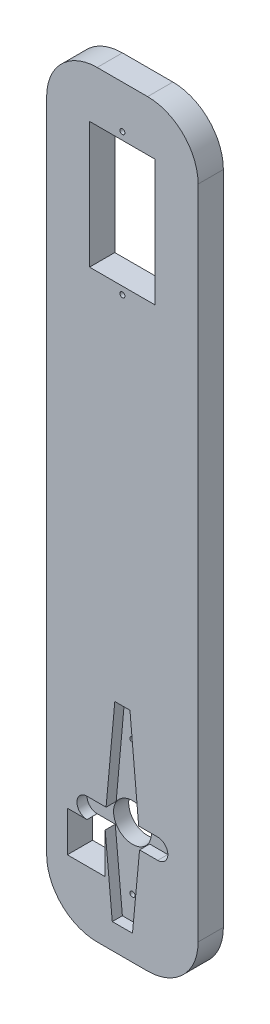
ISO-10303-21;
HEADER;
FILE_DESCRIPTION(('STEP AP214'),'2;1');
FILE_NAME('part.step','',(''),(''),'','','');
FILE_SCHEMA(('AUTOMOTIVE_DESIGN { 1 0 10303 214 1 1 1 1 }'));
ENDSEC;
DATA;
#1=APPLICATION_CONTEXT('core data for automotive mechanical design processes');
#2=APPLICATION_PROTOCOL_DEFINITION('international standard','automotive_design',2000,#1);
#3=PRODUCT_CONTEXT('',#1,'mechanical');
#4=PRODUCT('Part','Part','',(#3));
#5=PRODUCT_RELATED_PRODUCT_CATEGORY('part','',(#4));
#6=PRODUCT_DEFINITION_FORMATION('','',#4);
#7=PRODUCT_DEFINITION_CONTEXT('part definition',#1,'design');
#8=PRODUCT_DEFINITION('design','',#6,#7);
#9=PRODUCT_DEFINITION_SHAPE('','',#8);
#10=(LENGTH_UNIT() NAMED_UNIT(*) SI_UNIT(.MILLI.,.METRE.));
#11=(NAMED_UNIT(*) PLANE_ANGLE_UNIT() SI_UNIT($,.RADIAN.));
#12=(NAMED_UNIT(*) SI_UNIT($,.STERADIAN.) SOLID_ANGLE_UNIT());
#13=UNCERTAINTY_MEASURE_WITH_UNIT(LENGTH_MEASURE(1.E-05),#10,'distance_accuracy_value','');
#14=(GEOMETRIC_REPRESENTATION_CONTEXT(3) GLOBAL_UNCERTAINTY_ASSIGNED_CONTEXT((#13)) GLOBAL_UNIT_ASSIGNED_CONTEXT((#10,
#11,#12)) REPRESENTATION_CONTEXT('',''));
#15=CARTESIAN_POINT('',(0.,0.,0.));
#16=DIRECTION('',(0.,0.,1.));
#17=DIRECTION('',(1.,0.,0.));
#18=AXIS2_PLACEMENT_3D('',#15,#16,#17);
#19=CARTESIAN_POINT('',(0.,0.,5.));
#20=DIRECTION('',(0.,0.,-1.));
#21=DIRECTION('',(-1.,0.,0.));
#22=AXIS2_PLACEMENT_3D('',#19,#20,#21);
#23=PLANE('',#22);
#24=DIRECTION('',(1.,0.,0.));
#25=VECTOR('',#24,1.);
#26=CARTESIAN_POINT('',(0.,0.,5.));
#27=LINE('',#26,#25);
#28=CARTESIAN_POINT('',(10.,0.,5.));
#29=VERTEX_POINT('',#28);
#30=CARTESIAN_POINT('',(20.,0.,5.));
#31=VERTEX_POINT('',#30);
#32=EDGE_CURVE('E410',#29,#31,#27,.T.);
#33=ORIENTED_EDGE('',*,*,#32,.T.);
#34=CARTESIAN_POINT('',(20.,10.,5.));
#35=DIRECTION('',(0.,0.,-1.));
#36=DIRECTION('',(-1.,0.,0.));
#37=AXIS2_PLACEMENT_3D('',#34,#35,#36);
#38=CIRCLE('',#37,10.);
#39=CARTESIAN_POINT('',(30.,10.,5.));
#40=VERTEX_POINT('',#39);
#41=EDGE_CURVE('E454',#31,#40,#38,.F.);
#42=ORIENTED_EDGE('',*,*,#41,.T.);
#43=DIRECTION('',(0.,1.,0.));
#44=VECTOR('',#43,1.);
#45=CARTESIAN_POINT('',(30.,0.,5.));
#46=LINE('',#45,#44);
#47=CARTESIAN_POINT('',(30.,140.,5.));
#48=VERTEX_POINT('',#47);
#49=EDGE_CURVE('E414',#40,#48,#46,.T.);
#50=ORIENTED_EDGE('',*,*,#49,.T.);
#51=CARTESIAN_POINT('',(20.,140.,5.));
#52=DIRECTION('',(0.,0.,-1.));
#53=DIRECTION('',(-1.,0.,0.));
#54=AXIS2_PLACEMENT_3D('',#51,#52,#53);
#55=CIRCLE('',#54,10.);
#56=CARTESIAN_POINT('',(20.,150.,5.));
#57=VERTEX_POINT('',#56);
#58=EDGE_CURVE('E450',#48,#57,#55,.F.);
#59=ORIENTED_EDGE('',*,*,#58,.T.);
#60=DIRECTION('',(-1.,0.,0.));
#61=VECTOR('',#60,1.);
#62=CARTESIAN_POINT('',(0.,150.,5.));
#63=LINE('',#62,#61);
#64=CARTESIAN_POINT('',(10.,150.,5.));
#65=VERTEX_POINT('',#64);
#66=EDGE_CURVE('E417',#57,#65,#63,.T.);
#67=ORIENTED_EDGE('',*,*,#66,.T.);
#68=CARTESIAN_POINT('',(10.,140.,5.));
#69=DIRECTION('',(0.,0.,-1.));
#70=DIRECTION('',(-1.,0.,0.));
#71=AXIS2_PLACEMENT_3D('',#68,#69,#70);
#72=CIRCLE('',#71,10.);
#73=CARTESIAN_POINT('',(0.,140.,5.));
#74=VERTEX_POINT('',#73);
#75=EDGE_CURVE('E448',#65,#74,#72,.F.);
#76=ORIENTED_EDGE('',*,*,#75,.T.);
#77=DIRECTION('',(0.,-1.,0.));
#78=VECTOR('',#77,1.);
#79=CARTESIAN_POINT('',(0.,0.,5.));
#80=LINE('',#79,#78);
#81=CARTESIAN_POINT('',(0.,10.,5.));
#82=VERTEX_POINT('',#81);
#83=EDGE_CURVE('E407',#74,#82,#80,.T.);
#84=ORIENTED_EDGE('',*,*,#83,.T.);
#85=CARTESIAN_POINT('',(10.,10.,5.));
#86=DIRECTION('',(0.,0.,-1.));
#87=DIRECTION('',(-1.,0.,0.));
#88=AXIS2_PLACEMENT_3D('',#85,#86,#87);
#89=CIRCLE('',#88,10.);
#90=EDGE_CURVE('E452',#82,#29,#89,.F.);
#91=ORIENTED_EDGE('',*,*,#90,.T.);
#92=EDGE_LOOP('',(#33,#42,#50,#59,#67,#76,#84,#91));
#93=FACE_BOUND('',#92,.T.);
#94=DIRECTION('',(1.,0.,0.));
#95=VECTOR('',#94,1.);
#96=CARTESIAN_POINT('',(8.5,115.,5.));
#97=LINE('',#96,#95);
#98=CARTESIAN_POINT('',(8.5,115.,5.));
#99=VERTEX_POINT('',#98);
#100=CARTESIAN_POINT('',(21.5,115.,5.));
#101=VERTEX_POINT('',#100);
#102=EDGE_CURVE('E390',#99,#101,#97,.T.);
#103=ORIENTED_EDGE('',*,*,#102,.F.);
#104=DIRECTION('',(0.,-1.,0.));
#105=VECTOR('',#104,1.);
#106=CARTESIAN_POINT('',(8.5,140.,5.));
#107=LINE('',#106,#105);
#108=CARTESIAN_POINT('',(8.5,140.,5.));
#109=VERTEX_POINT('',#108);
#110=EDGE_CURVE('E366',#109,#99,#107,.T.);
#111=ORIENTED_EDGE('',*,*,#110,.F.);
#112=DIRECTION('',(-1.,0.,0.));
#113=VECTOR('',#112,1.);
#114=CARTESIAN_POINT('',(8.5,140.,5.));
#115=LINE('',#114,#113);
#116=CARTESIAN_POINT('',(21.5,140.,5.));
#117=VERTEX_POINT('',#116);
#118=EDGE_CURVE('E379',#117,#109,#115,.T.);
#119=ORIENTED_EDGE('',*,*,#118,.F.);
#120=DIRECTION('',(0.,1.,0.));
#121=VECTOR('',#120,1.);
#122=CARTESIAN_POINT('',(21.5,140.,5.));
#123=LINE('',#122,#121);
#124=EDGE_CURVE('E393',#101,#117,#123,.T.);
#125=ORIENTED_EDGE('',*,*,#124,.F.);
#126=EDGE_LOOP('',(#103,#111,#119,#125));
#127=FACE_BOUND('',#126,.T.);
#128=CARTESIAN_POINT('',(15.,113.5,5.));
#129=DIRECTION('',(0.,0.,1.));
#130=DIRECTION('',(-1.,0.,0.));
#131=AXIS2_PLACEMENT_3D('',#128,#129,#130);
#132=CIRCLE('',#131,0.500000000000001);
#133=CARTESIAN_POINT('',(14.5,113.5,5.));
#134=VERTEX_POINT('',#133);
#135=EDGE_CURVE('E342',#134,#134,#132,.T.);
#136=ORIENTED_EDGE('',*,*,#135,.F.);
#137=EDGE_LOOP('',(#136));
#138=FACE_BOUND('',#137,.T.);
#139=CARTESIAN_POINT('',(15.,141.5,5.));
#140=DIRECTION('',(0.,0.,1.));
#141=DIRECTION('',(1.,0.,0.));
#142=AXIS2_PLACEMENT_3D('',#139,#140,#141);
#143=CIRCLE('',#142,0.500000000000001);
#144=CARTESIAN_POINT('',(15.5,141.5,5.));
#145=VERTEX_POINT('',#144);
#146=EDGE_CURVE('E367',#145,#145,#143,.T.);
#147=ORIENTED_EDGE('',*,*,#146,.F.);
#148=EDGE_LOOP('',(#147));
#149=FACE_BOUND('',#148,.T.);
#150=DIRECTION('',(0.0933407086930581,-0.995634226059288,0.));
#151=VECTOR('',#150,1.);
#152=CARTESIAN_POINT('',(13.351403678606,1.25169409486931,5.));
#153=LINE('',#152,#151);
#154=CARTESIAN_POINT('',(11.59375,20.,5.));
#155=VERTEX_POINT('',#154);
#156=CARTESIAN_POINT('',(13.,5.,5.));
#157=VERTEX_POINT('',#156);
#158=EDGE_CURVE('E326',#155,#157,#153,.T.);
#159=ORIENTED_EDGE('',*,*,#158,.F.);
#160=DIRECTION('',(0.,1.,0.));
#161=VECTOR('',#160,1.);
#162=CARTESIAN_POINT('',(11.59375,20.,5.));
#163=LINE('',#162,#161);
#164=CARTESIAN_POINT('',(11.59375,12.,5.));
#165=VERTEX_POINT('',#164);
#166=EDGE_CURVE('E246',#165,#155,#163,.T.);
#167=ORIENTED_EDGE('',*,*,#166,.F.);
#168=DIRECTION('',(1.,0.,0.));
#169=VECTOR('',#168,1.);
#170=CARTESIAN_POINT('',(11.59375,12.,5.));
#171=LINE('',#170,#169);
#172=CARTESIAN_POINT('',(4.09375,12.,5.));
#173=VERTEX_POINT('',#172);
#174=EDGE_CURVE('E238',#173,#165,#171,.T.);
#175=ORIENTED_EDGE('',*,*,#174,.F.);
#176=DIRECTION('',(0.,-1.,0.));
#177=VECTOR('',#176,1.);
#178=CARTESIAN_POINT('',(4.09375,20.,5.));
#179=LINE('',#178,#177);
#180=CARTESIAN_POINT('',(4.09375,20.,5.));
#181=VERTEX_POINT('',#180);
#182=EDGE_CURVE('E241',#181,#173,#179,.T.);
#183=ORIENTED_EDGE('',*,*,#182,.F.);
#184=DIRECTION('',(-1.,0.,0.));
#185=VECTOR('',#184,1.);
#186=CARTESIAN_POINT('',(11.59375,20.,5.));
#187=LINE('',#186,#185);
#188=CARTESIAN_POINT('',(8.,20.,5.));
#189=VERTEX_POINT('',#188);
#190=EDGE_CURVE('E248',#189,#181,#187,.T.);
#191=ORIENTED_EDGE('',*,*,#190,.F.);
#192=CARTESIAN_POINT('',(8.,22.,5.));
#193=DIRECTION('',(0.,0.,1.));
#194=DIRECTION('',(1.,0.,0.));
#195=AXIS2_PLACEMENT_3D('',#192,#193,#194);
#196=CIRCLE('',#195,2.);
#197=CARTESIAN_POINT('',(8.,24.,5.));
#198=VERTEX_POINT('',#197);
#199=EDGE_CURVE('E323',#198,#189,#196,.T.);
#200=ORIENTED_EDGE('',*,*,#199,.F.);
#201=DIRECTION('',(1.,0.,0.));
#202=VECTOR('',#201,1.);
#203=CARTESIAN_POINT('',(0.,24.,5.));
#204=LINE('',#203,#202);
#205=CARTESIAN_POINT('',(11.7727272727273,24.,5.));
#206=VERTEX_POINT('',#205);
#207=EDGE_CURVE('E320',#198,#206,#204,.T.);
#208=ORIENTED_EDGE('',*,*,#207,.T.);
#209=DIRECTION('',(-0.0905357460425186,-0.995893206467704,0.));
#210=VECTOR('',#209,1.);
#211=CARTESIAN_POINT('',(9.51229508196721,-0.864754098360656,5.));
#212=LINE('',#211,#210);
#213=CARTESIAN_POINT('',(13.5,43.,5.));
#214=VERTEX_POINT('',#213);
#215=EDGE_CURVE('E317',#214,#206,#212,.T.);
#216=ORIENTED_EDGE('',*,*,#215,.F.);
#217=DIRECTION('',(1.,0.,0.));
#218=VECTOR('',#217,1.);
#219=CARTESIAN_POINT('',(0.,43.,5.));
#220=LINE('',#219,#218);
#221=CARTESIAN_POINT('',(16.5,43.,5.));
#222=VERTEX_POINT('',#221);
#223=EDGE_CURVE('E314',#214,#222,#220,.T.);
#224=ORIENTED_EDGE('',*,*,#223,.T.);
#225=DIRECTION('',(-0.0905357460425185,0.995893206467704,0.));
#226=VECTOR('',#225,1.);
#227=CARTESIAN_POINT('',(20.2418032786885,1.84016393442623,5.));
#228=LINE('',#227,#226);
#229=CARTESIAN_POINT('',(18.2272727272727,24.,5.));
#230=VERTEX_POINT('',#229);
#231=EDGE_CURVE('E311',#230,#222,#228,.T.);
#232=ORIENTED_EDGE('',*,*,#231,.F.);
#233=DIRECTION('',(1.,0.,0.));
#234=VECTOR('',#233,1.);
#235=CARTESIAN_POINT('',(0.,24.,5.));
#236=LINE('',#235,#234);
#237=CARTESIAN_POINT('',(22.,24.,5.));
#238=VERTEX_POINT('',#237);
#239=EDGE_CURVE('E56',#230,#238,#236,.T.);
#240=ORIENTED_EDGE('',*,*,#239,.T.);
#241=CARTESIAN_POINT('',(22.,22.,5.));
#242=DIRECTION('',(0.,0.,1.));
#243=DIRECTION('',(1.,0.,0.));
#244=AXIS2_PLACEMENT_3D('',#241,#242,#243);
#245=CIRCLE('',#244,2.);
#246=CARTESIAN_POINT('',(22.,20.,5.));
#247=VERTEX_POINT('',#246);
#248=EDGE_CURVE('E279',#238,#247,#245,.F.);
#249=ORIENTED_EDGE('',*,*,#248,.T.);
#250=DIRECTION('',(1.,0.,0.));
#251=VECTOR('',#250,1.);
#252=CARTESIAN_POINT('',(0.,20.,5.));
#253=LINE('',#252,#251);
#254=CARTESIAN_POINT('',(18.40625,20.,5.));
#255=VERTEX_POINT('',#254);
#256=EDGE_CURVE('E335',#255,#247,#253,.T.);
#257=ORIENTED_EDGE('',*,*,#256,.F.);
#258=DIRECTION('',(0.0933407086930581,0.995634226059288,0.));
#259=VECTOR('',#258,1.);
#260=CARTESIAN_POINT('',(16.3872216844143,-1.53630203291384,5.));
#261=LINE('',#260,#259);
#262=CARTESIAN_POINT('',(17.,5.,5.));
#263=VERTEX_POINT('',#262);
#264=EDGE_CURVE('E332',#263,#255,#261,.T.);
#265=ORIENTED_EDGE('',*,*,#264,.F.);
#266=DIRECTION('',(1.,0.,0.));
#267=VECTOR('',#266,1.);
#268=CARTESIAN_POINT('',(0.,5.,5.));
#269=LINE('',#268,#267);
#270=EDGE_CURVE('E329',#157,#263,#269,.T.);
#271=ORIENTED_EDGE('',*,*,#270,.F.);
#272=EDGE_LOOP('',(#159,#167,#175,#183,#191,#200,#208,#216,#224,#232,#240,#249,#257,#265,#271));
#273=FACE_BOUND('',#272,.T.);
#274=ADVANCED_FACE('F33',(#93,#127,#138,#149,#273),#23,.F.);
#275=CARTESIAN_POINT('',(0.,0.,5.));
#276=DIRECTION('',(1.,0.,0.));
#277=DIRECTION('',(0.,0.,-1.));
#278=AXIS2_PLACEMENT_3D('',#275,#276,#277);
#279=PLANE('',#278);
#280=DIRECTION('',(0.,-1.,0.));
#281=VECTOR('',#280,1.);
#282=CARTESIAN_POINT('',(0.,0.,0.));
#283=LINE('',#282,#281);
#284=CARTESIAN_POINT('',(0.,140.,0.));
#285=VERTEX_POINT('',#284);
#286=CARTESIAN_POINT('',(0.,10.,0.));
#287=VERTEX_POINT('',#286);
#288=EDGE_CURVE('E400',#285,#287,#283,.T.);
#289=ORIENTED_EDGE('',*,*,#288,.T.);
#290=DIRECTION('',(0.,0.,-1.));
#291=VECTOR('',#290,1.);
#292=CARTESIAN_POINT('',(0.,10.,5.));
#293=LINE('',#292,#291);
#294=EDGE_CURVE('E459',#287,#82,#293,.F.);
#295=ORIENTED_EDGE('',*,*,#294,.T.);
#296=ORIENTED_EDGE('',*,*,#83,.F.);
#297=DIRECTION('',(0.,0.,-1.));
#298=VECTOR('',#297,1.);
#299=CARTESIAN_POINT('',(0.,140.,5.));
#300=LINE('',#299,#298);
#301=EDGE_CURVE('E456',#74,#285,#300,.T.);
#302=ORIENTED_EDGE('',*,*,#301,.T.);
#303=EDGE_LOOP('',(#289,#295,#296,#302));
#304=FACE_BOUND('',#303,.T.);
#305=ADVANCED_FACE('F475',(#304),#279,.F.);
#306=CARTESIAN_POINT('',(0.,0.,5.));
#307=DIRECTION('',(0.,1.,0.));
#308=DIRECTION('',(0.,0.,1.));
#309=AXIS2_PLACEMENT_3D('',#306,#307,#308);
#310=PLANE('',#309);
#311=DIRECTION('',(1.,0.,0.));
#312=VECTOR('',#311,1.);
#313=CARTESIAN_POINT('',(0.,0.,0.));
#314=LINE('',#313,#312);
#315=CARTESIAN_POINT('',(10.,0.,0.));
#316=VERTEX_POINT('',#315);
#317=CARTESIAN_POINT('',(20.,0.,0.));
#318=VERTEX_POINT('',#317);
#319=EDGE_CURVE('E423',#316,#318,#314,.T.);
#320=ORIENTED_EDGE('',*,*,#319,.T.);
#321=DIRECTION('',(0.,0.,-1.));
#322=VECTOR('',#321,1.);
#323=CARTESIAN_POINT('',(20.,0.,5.));
#324=LINE('',#323,#322);
#325=EDGE_CURVE('E446',#318,#31,#324,.F.);
#326=ORIENTED_EDGE('',*,*,#325,.T.);
#327=ORIENTED_EDGE('',*,*,#32,.F.);
#328=DIRECTION('',(0.,0.,-1.));
#329=VECTOR('',#328,1.);
#330=CARTESIAN_POINT('',(10.,0.,5.));
#331=LINE('',#330,#329);
#332=EDGE_CURVE('E443',#29,#316,#331,.T.);
#333=ORIENTED_EDGE('',*,*,#332,.T.);
#334=EDGE_LOOP('',(#320,#326,#327,#333));
#335=FACE_BOUND('',#334,.T.);
#336=ADVANCED_FACE('F486',(#335),#310,.F.);
#337=CARTESIAN_POINT('',(30.,0.,5.));
#338=DIRECTION('',(-1.,0.,0.));
#339=DIRECTION('',(0.,0.,1.));
#340=AXIS2_PLACEMENT_3D('',#337,#338,#339);
#341=PLANE('',#340);
#342=ORIENTED_EDGE('',*,*,#49,.F.);
#343=DIRECTION('',(0.,0.,-1.));
#344=VECTOR('',#343,1.);
#345=CARTESIAN_POINT('',(30.,10.,5.));
#346=LINE('',#345,#344);
#347=CARTESIAN_POINT('',(30.,10.,0.));
#348=VERTEX_POINT('',#347);
#349=EDGE_CURVE('E432',#40,#348,#346,.T.);
#350=ORIENTED_EDGE('',*,*,#349,.T.);
#351=DIRECTION('',(0.,1.,0.));
#352=VECTOR('',#351,1.);
#353=CARTESIAN_POINT('',(30.,0.,0.));
#354=LINE('',#353,#352);
#355=CARTESIAN_POINT('',(30.,140.,0.));
#356=VERTEX_POINT('',#355);
#357=EDGE_CURVE('E426',#348,#356,#354,.T.);
#358=ORIENTED_EDGE('',*,*,#357,.T.);
#359=DIRECTION('',(0.,0.,-1.));
#360=VECTOR('',#359,1.);
#361=CARTESIAN_POINT('',(30.,140.,5.));
#362=LINE('',#361,#360);
#363=EDGE_CURVE('E420',#356,#48,#362,.F.);
#364=ORIENTED_EDGE('',*,*,#363,.T.);
#365=EDGE_LOOP('',(#342,#350,#358,#364));
#366=FACE_BOUND('',#365,.T.);
#367=ADVANCED_FACE('F494',(#366),#341,.F.);
#368=CARTESIAN_POINT('',(0.,150.,5.));
#369=DIRECTION('',(0.,-1.,0.));
#370=DIRECTION('',(0.,0.,-1.));
#371=AXIS2_PLACEMENT_3D('',#368,#369,#370);
#372=PLANE('',#371);
#373=ORIENTED_EDGE('',*,*,#66,.F.);
#374=DIRECTION('',(0.,0.,-1.));
#375=VECTOR('',#374,1.);
#376=CARTESIAN_POINT('',(20.,150.,5.));
#377=LINE('',#376,#375);
#378=CARTESIAN_POINT('',(20.,150.,0.));
#379=VERTEX_POINT('',#378);
#380=EDGE_CURVE('E11',#57,#379,#377,.T.);
#381=ORIENTED_EDGE('',*,*,#380,.T.);
#382=DIRECTION('',(-1.,0.,0.));
#383=VECTOR('',#382,1.);
#384=CARTESIAN_POINT('',(0.,150.,0.));
#385=LINE('',#384,#383);
#386=CARTESIAN_POINT('',(10.,150.,0.));
#387=VERTEX_POINT('',#386);
#388=EDGE_CURVE('E411',#379,#387,#385,.T.);
#389=ORIENTED_EDGE('',*,*,#388,.T.);
#390=DIRECTION('',(0.,0.,-1.));
#391=VECTOR('',#390,1.);
#392=CARTESIAN_POINT('',(10.,150.,5.));
#393=LINE('',#392,#391);
#394=EDGE_CURVE('E41',#387,#65,#393,.F.);
#395=ORIENTED_EDGE('',*,*,#394,.T.);
#396=EDGE_LOOP('',(#373,#381,#389,#395));
#397=FACE_BOUND('',#396,.T.);
#398=ADVANCED_FACE('F463',(#397),#372,.F.);
#399=CARTESIAN_POINT('',(0.,0.,0.));
#400=DIRECTION('',(0.,0.,-1.));
#401=DIRECTION('',(-1.,0.,0.));
#402=AXIS2_PLACEMENT_3D('',#399,#400,#401);
#403=PLANE('',#402);
#404=DIRECTION('',(0.,1.,0.));
#405=VECTOR('',#404,1.);
#406=CARTESIAN_POINT('',(11.59375,20.,0.));
#407=LINE('',#406,#405);
#408=CARTESIAN_POINT('',(11.59375,12.,0.));
#409=VERTEX_POINT('',#408);
#410=CARTESIAN_POINT('',(11.59375,20.,0.));
#411=VERTEX_POINT('',#410);
#412=EDGE_CURVE('E221',#409,#411,#407,.T.);
#413=ORIENTED_EDGE('',*,*,#412,.T.);
#414=DIRECTION('',(-1.,0.,0.));
#415=VECTOR('',#414,1.);
#416=CARTESIAN_POINT('',(11.59375,20.,0.));
#417=LINE('',#416,#415);
#418=CARTESIAN_POINT('',(4.09375,20.,0.));
#419=VERTEX_POINT('',#418);
#420=EDGE_CURVE('E231',#411,#419,#417,.T.);
#421=ORIENTED_EDGE('',*,*,#420,.T.);
#422=DIRECTION('',(0.,-1.,0.));
#423=VECTOR('',#422,1.);
#424=CARTESIAN_POINT('',(4.09375,20.,0.));
#425=LINE('',#424,#423);
#426=CARTESIAN_POINT('',(4.09375,12.,0.));
#427=VERTEX_POINT('',#426);
#428=EDGE_CURVE('E48',#419,#427,#425,.T.);
#429=ORIENTED_EDGE('',*,*,#428,.T.);
#430=DIRECTION('',(1.,0.,0.));
#431=VECTOR('',#430,1.);
#432=CARTESIAN_POINT('',(11.59375,12.,0.));
#433=LINE('',#432,#431);
#434=EDGE_CURVE('E228',#427,#409,#433,.T.);
#435=ORIENTED_EDGE('',*,*,#434,.T.);
#436=EDGE_LOOP('',(#413,#421,#429,#435));
#437=FACE_BOUND('',#436,.T.);
#438=CARTESIAN_POINT('',(15.,22.,0.));
#439=DIRECTION('',(0.,0.,1.));
#440=DIRECTION('',(1.,0.,0.));
#441=AXIS2_PLACEMENT_3D('',#438,#439,#440);
#442=CIRCLE('',#441,3.75);
#443=CARTESIAN_POINT('',(18.75,22.,0.));
#444=VERTEX_POINT('',#443);
#445=EDGE_CURVE('E258',#444,#444,#442,.T.);
#446=ORIENTED_EDGE('',*,*,#445,.T.);
#447=EDGE_LOOP('',(#446));
#448=FACE_BOUND('',#447,.T.);
#449=CARTESIAN_POINT('',(15.,36.2,0.));
#450=DIRECTION('',(0.,0.,1.));
#451=DIRECTION('',(1.,0.,0.));
#452=AXIS2_PLACEMENT_3D('',#449,#450,#451);
#453=CIRCLE('',#452,0.500000000000001);
#454=CARTESIAN_POINT('',(15.5,36.2,0.));
#455=VERTEX_POINT('',#454);
#456=EDGE_CURVE('E264',#455,#455,#453,.T.);
#457=ORIENTED_EDGE('',*,*,#456,.T.);
#458=EDGE_LOOP('',(#457));
#459=FACE_BOUND('',#458,.T.);
#460=CARTESIAN_POINT('',(15.,9.69999999999999,0.));
#461=DIRECTION('',(0.,0.,1.));
#462=DIRECTION('',(1.,0.,0.));
#463=AXIS2_PLACEMENT_3D('',#460,#461,#462);
#464=CIRCLE('',#463,0.500000000000001);
#465=CARTESIAN_POINT('',(15.5,9.69999999999999,0.));
#466=VERTEX_POINT('',#465);
#467=EDGE_CURVE('E270',#466,#466,#464,.T.);
#468=ORIENTED_EDGE('',*,*,#467,.T.);
#469=EDGE_LOOP('',(#468));
#470=FACE_BOUND('',#469,.T.);
#471=CARTESIAN_POINT('',(15.,141.5,0.));
#472=DIRECTION('',(0.,0.,1.));
#473=DIRECTION('',(1.,0.,0.));
#474=AXIS2_PLACEMENT_3D('',#471,#472,#473);
#475=CIRCLE('',#474,0.500000000000001);
#476=CARTESIAN_POINT('',(15.5,141.5,0.));
#477=VERTEX_POINT('',#476);
#478=EDGE_CURVE('E363',#477,#477,#475,.T.);
#479=ORIENTED_EDGE('',*,*,#478,.T.);
#480=EDGE_LOOP('',(#479));
#481=FACE_BOUND('',#480,.T.);
#482=CARTESIAN_POINT('',(15.,113.5,0.));
#483=DIRECTION('',(0.,0.,1.));
#484=DIRECTION('',(-1.,0.,0.));
#485=AXIS2_PLACEMENT_3D('',#482,#483,#484);
#486=CIRCLE('',#485,0.500000000000001);
#487=CARTESIAN_POINT('',(14.5,113.5,0.));
#488=VERTEX_POINT('',#487);
#489=EDGE_CURVE('E370',#488,#488,#486,.T.);
#490=ORIENTED_EDGE('',*,*,#489,.T.);
#491=EDGE_LOOP('',(#490));
#492=FACE_BOUND('',#491,.T.);
#493=DIRECTION('',(0.,-1.,0.));
#494=VECTOR('',#493,1.);
#495=CARTESIAN_POINT('',(8.5,140.,0.));
#496=LINE('',#495,#494);
#497=CARTESIAN_POINT('',(8.5,140.,0.));
#498=VERTEX_POINT('',#497);
#499=CARTESIAN_POINT('',(8.5,115.,0.));
#500=VERTEX_POINT('',#499);
#501=EDGE_CURVE('E375',#498,#500,#496,.T.);
#502=ORIENTED_EDGE('',*,*,#501,.T.);
#503=DIRECTION('',(1.,0.,0.));
#504=VECTOR('',#503,1.);
#505=CARTESIAN_POINT('',(8.5,115.,0.));
#506=LINE('',#505,#504);
#507=CARTESIAN_POINT('',(21.5,115.,0.));
#508=VERTEX_POINT('',#507);
#509=EDGE_CURVE('E378',#500,#508,#506,.T.);
#510=ORIENTED_EDGE('',*,*,#509,.T.);
#511=DIRECTION('',(0.,1.,0.));
#512=VECTOR('',#511,1.);
#513=CARTESIAN_POINT('',(21.5,140.,0.));
#514=LINE('',#513,#512);
#515=CARTESIAN_POINT('',(21.5,140.,0.));
#516=VERTEX_POINT('',#515);
#517=EDGE_CURVE('E382',#508,#516,#514,.T.);
#518=ORIENTED_EDGE('',*,*,#517,.T.);
#519=DIRECTION('',(-1.,0.,0.));
#520=VECTOR('',#519,1.);
#521=CARTESIAN_POINT('',(8.5,140.,0.));
#522=LINE('',#521,#520);
#523=EDGE_CURVE('E385',#516,#498,#522,.T.);
#524=ORIENTED_EDGE('',*,*,#523,.T.);
#525=EDGE_LOOP('',(#502,#510,#518,#524));
#526=FACE_BOUND('',#525,.T.);
#527=ORIENTED_EDGE('',*,*,#357,.F.);
#528=CARTESIAN_POINT('',(20.,10.,0.));
#529=DIRECTION('',(0.,0.,-1.));
#530=DIRECTION('',(-1.,0.,0.));
#531=AXIS2_PLACEMENT_3D('',#528,#529,#530);
#532=CIRCLE('',#531,10.);
#533=EDGE_CURVE('E441',#348,#318,#532,.T.);
#534=ORIENTED_EDGE('',*,*,#533,.T.);
#535=ORIENTED_EDGE('',*,*,#319,.F.);
#536=CARTESIAN_POINT('',(10.,10.,0.));
#537=DIRECTION('',(0.,0.,-1.));
#538=DIRECTION('',(-1.,0.,0.));
#539=AXIS2_PLACEMENT_3D('',#536,#537,#538);
#540=CIRCLE('',#539,10.);
#541=EDGE_CURVE('E439',#316,#287,#540,.T.);
#542=ORIENTED_EDGE('',*,*,#541,.T.);
#543=ORIENTED_EDGE('',*,*,#288,.F.);
#544=CARTESIAN_POINT('',(10.,140.,0.));
#545=DIRECTION('',(0.,0.,-1.));
#546=DIRECTION('',(-1.,0.,0.));
#547=AXIS2_PLACEMENT_3D('',#544,#545,#546);
#548=CIRCLE('',#547,10.);
#549=EDGE_CURVE('E435',#285,#387,#548,.T.);
#550=ORIENTED_EDGE('',*,*,#549,.T.);
#551=ORIENTED_EDGE('',*,*,#388,.F.);
#552=CARTESIAN_POINT('',(20.,140.,0.));
#553=DIRECTION('',(0.,0.,-1.));
#554=DIRECTION('',(-1.,0.,0.));
#555=AXIS2_PLACEMENT_3D('',#552,#553,#554);
#556=CIRCLE('',#555,10.);
#557=EDGE_CURVE('E437',#379,#356,#556,.T.);
#558=ORIENTED_EDGE('',*,*,#557,.T.);
#559=EDGE_LOOP('',(#527,#534,#535,#542,#543,#550,#551,#558));
#560=FACE_BOUND('',#559,.T.);
#561=ADVANCED_FACE('F235',(#437,#448,#459,#470,#481,#492,#526,#560),#403,.T.);
#562=CARTESIAN_POINT('',(20.,10.,5.));
#563=DIRECTION('',(0.,0.,-1.));
#564=DIRECTION('',(-1.,0.,0.));
#565=AXIS2_PLACEMENT_3D('',#562,#563,#564);
#566=CYLINDRICAL_SURFACE('',#565,10.);
#567=ORIENTED_EDGE('',*,*,#41,.F.);
#568=ORIENTED_EDGE('',*,*,#325,.F.);
#569=ORIENTED_EDGE('',*,*,#533,.F.);
#570=ORIENTED_EDGE('',*,*,#349,.F.);
#571=EDGE_LOOP('',(#567,#568,#569,#570));
#572=FACE_BOUND('',#571,.T.);
#573=ADVANCED_FACE('F492',(#572),#566,.T.);
#574=CARTESIAN_POINT('',(10.,10.,5.));
#575=DIRECTION('',(0.,0.,-1.));
#576=DIRECTION('',(-1.,0.,0.));
#577=AXIS2_PLACEMENT_3D('',#574,#575,#576);
#578=CYLINDRICAL_SURFACE('',#577,10.);
#579=ORIENTED_EDGE('',*,*,#90,.F.);
#580=ORIENTED_EDGE('',*,*,#294,.F.);
#581=ORIENTED_EDGE('',*,*,#541,.F.);
#582=ORIENTED_EDGE('',*,*,#332,.F.);
#583=EDGE_LOOP('',(#579,#580,#581,#582));
#584=FACE_BOUND('',#583,.T.);
#585=ADVANCED_FACE('F483',(#584),#578,.T.);
#586=CARTESIAN_POINT('',(20.,140.,5.));
#587=DIRECTION('',(0.,0.,-1.));
#588=DIRECTION('',(-1.,0.,0.));
#589=AXIS2_PLACEMENT_3D('',#586,#587,#588);
#590=CYLINDRICAL_SURFACE('',#589,10.);
#591=ORIENTED_EDGE('',*,*,#58,.F.);
#592=ORIENTED_EDGE('',*,*,#363,.F.);
#593=ORIENTED_EDGE('',*,*,#557,.F.);
#594=ORIENTED_EDGE('',*,*,#380,.F.);
#595=EDGE_LOOP('',(#591,#592,#593,#594));
#596=FACE_BOUND('',#595,.T.);
#597=ADVANCED_FACE('F497',(#596),#590,.T.);
#598=CARTESIAN_POINT('',(10.,140.,5.));
#599=DIRECTION('',(0.,0.,-1.));
#600=DIRECTION('',(-1.,0.,0.));
#601=AXIS2_PLACEMENT_3D('',#598,#599,#600);
#602=CYLINDRICAL_SURFACE('',#601,10.);
#603=ORIENTED_EDGE('',*,*,#75,.F.);
#604=ORIENTED_EDGE('',*,*,#394,.F.);
#605=ORIENTED_EDGE('',*,*,#549,.F.);
#606=ORIENTED_EDGE('',*,*,#301,.F.);
#607=EDGE_LOOP('',(#603,#604,#605,#606));
#608=FACE_BOUND('',#607,.T.);
#609=ADVANCED_FACE('F35',(#608),#602,.T.);
#610=CARTESIAN_POINT('',(8.5,140.,0.));
#611=DIRECTION('',(-1.,0.,0.));
#612=DIRECTION('',(0.,-1.,0.));
#613=AXIS2_PLACEMENT_3D('',#610,#611,#612);
#614=PLANE('',#613);
#615=ORIENTED_EDGE('',*,*,#110,.T.);
#616=DIRECTION('',(0.,0.,1.));
#617=VECTOR('',#616,1.);
#618=CARTESIAN_POINT('',(8.5,115.,0.));
#619=LINE('',#618,#617);
#620=EDGE_CURVE('E388',#500,#99,#619,.T.);
#621=ORIENTED_EDGE('',*,*,#620,.F.);
#622=ORIENTED_EDGE('',*,*,#501,.F.);
#623=DIRECTION('',(0.,0.,1.));
#624=VECTOR('',#623,1.);
#625=CARTESIAN_POINT('',(8.5,140.,0.));
#626=LINE('',#625,#624);
#627=EDGE_CURVE('E398',#498,#109,#626,.T.);
#628=ORIENTED_EDGE('',*,*,#627,.T.);
#629=EDGE_LOOP('',(#615,#621,#622,#628));
#630=FACE_BOUND('',#629,.T.);
#631=ADVANCED_FACE('F503',(#630),#614,.F.);
#632=CARTESIAN_POINT('',(8.5,140.,0.));
#633=DIRECTION('',(0.,1.,0.));
#634=DIRECTION('',(0.,0.,1.));
#635=AXIS2_PLACEMENT_3D('',#632,#633,#634);
#636=PLANE('',#635);
#637=ORIENTED_EDGE('',*,*,#118,.T.);
#638=ORIENTED_EDGE('',*,*,#627,.F.);
#639=ORIENTED_EDGE('',*,*,#523,.F.);
#640=DIRECTION('',(0.,0.,1.));
#641=VECTOR('',#640,1.);
#642=CARTESIAN_POINT('',(21.5,140.,0.));
#643=LINE('',#642,#641);
#644=EDGE_CURVE('E401',#516,#117,#643,.T.);
#645=ORIENTED_EDGE('',*,*,#644,.T.);
#646=EDGE_LOOP('',(#637,#638,#639,#645));
#647=FACE_BOUND('',#646,.T.);
#648=ADVANCED_FACE('F551',(#647),#636,.F.);
#649=CARTESIAN_POINT('',(21.5,140.,0.));
#650=DIRECTION('',(1.,0.,0.));
#651=DIRECTION('',(0.,1.,0.));
#652=AXIS2_PLACEMENT_3D('',#649,#650,#651);
#653=PLANE('',#652);
#654=ORIENTED_EDGE('',*,*,#124,.T.);
#655=ORIENTED_EDGE('',*,*,#644,.F.);
#656=ORIENTED_EDGE('',*,*,#517,.F.);
#657=DIRECTION('',(0.,0.,1.));
#658=VECTOR('',#657,1.);
#659=CARTESIAN_POINT('',(21.5,115.,0.));
#660=LINE('',#659,#658);
#661=EDGE_CURVE('E403',#508,#101,#660,.T.);
#662=ORIENTED_EDGE('',*,*,#661,.T.);
#663=EDGE_LOOP('',(#654,#655,#656,#662));
#664=FACE_BOUND('',#663,.T.);
#665=ADVANCED_FACE('F560',(#664),#653,.F.);
#666=CARTESIAN_POINT('',(8.5,115.,0.));
#667=DIRECTION('',(0.,-1.,0.));
#668=DIRECTION('',(0.,0.,-1.));
#669=AXIS2_PLACEMENT_3D('',#666,#667,#668);
#670=PLANE('',#669);
#671=ORIENTED_EDGE('',*,*,#102,.T.);
#672=ORIENTED_EDGE('',*,*,#661,.F.);
#673=ORIENTED_EDGE('',*,*,#509,.F.);
#674=ORIENTED_EDGE('',*,*,#620,.T.);
#675=EDGE_LOOP('',(#671,#672,#673,#674));
#676=FACE_BOUND('',#675,.T.);
#677=ADVANCED_FACE('F570',(#676),#670,.F.);
#678=CARTESIAN_POINT('',(15.,113.5,0.));
#679=DIRECTION('',(0.,0.,1.));
#680=DIRECTION('',(1.,0.,0.));
#681=AXIS2_PLACEMENT_3D('',#678,#679,#680);
#682=CYLINDRICAL_SURFACE('',#681,0.500000000000001);
#683=ORIENTED_EDGE('',*,*,#489,.F.);
#684=EDGE_LOOP('',(#683));
#685=FACE_BOUND('',#684,.T.);
#686=ORIENTED_EDGE('',*,*,#135,.T.);
#687=EDGE_LOOP('',(#686));
#688=FACE_BOUND('',#687,.T.);
#689=ADVANCED_FACE('F580',(#685,#688),#682,.F.);
#690=CARTESIAN_POINT('',(15.,141.5,0.));
#691=DIRECTION('',(0.,0.,1.));
#692=DIRECTION('',(1.,0.,0.));
#693=AXIS2_PLACEMENT_3D('',#690,#691,#692);
#694=CYLINDRICAL_SURFACE('',#693,0.500000000000001);
#695=ORIENTED_EDGE('',*,*,#478,.F.);
#696=EDGE_LOOP('',(#695));
#697=FACE_BOUND('',#696,.T.);
#698=ORIENTED_EDGE('',*,*,#146,.T.);
#699=EDGE_LOOP('',(#698));
#700=FACE_BOUND('',#699,.T.);
#701=ADVANCED_FACE('F589',(#697,#700),#694,.F.);
#702=CARTESIAN_POINT('',(0.,24.,3.));
#703=DIRECTION('',(0.,-1.,0.));
#704=DIRECTION('',(0.,0.,-1.));
#705=AXIS2_PLACEMENT_3D('',#702,#703,#704);
#706=PLANE('',#705);
#707=ORIENTED_EDGE('',*,*,#239,.F.);
#708=DIRECTION('',(0.,0.,1.));
#709=VECTOR('',#708,1.);
#710=CARTESIAN_POINT('',(18.2272727272727,24.,3.));
#711=LINE('',#710,#709);
#712=CARTESIAN_POINT('',(18.2272727272727,24.,3.));
#713=VERTEX_POINT('',#712);
#714=EDGE_CURVE('E309',#713,#230,#711,.T.);
#715=ORIENTED_EDGE('',*,*,#714,.F.);
#716=DIRECTION('',(1.,0.,0.));
#717=VECTOR('',#716,1.);
#718=CARTESIAN_POINT('',(0.,24.,3.));
#719=LINE('',#718,#717);
#720=CARTESIAN_POINT('',(22.,24.,3.));
#721=VERTEX_POINT('',#720);
#722=EDGE_CURVE('E275',#713,#721,#719,.T.);
#723=ORIENTED_EDGE('',*,*,#722,.T.);
#724=DIRECTION('',(0.,0.,1.));
#725=VECTOR('',#724,1.);
#726=CARTESIAN_POINT('',(22.,24.,3.));
#727=LINE('',#726,#725);
#728=EDGE_CURVE('E340',#721,#238,#727,.T.);
#729=ORIENTED_EDGE('',*,*,#728,.T.);
#730=EDGE_LOOP('',(#707,#715,#723,#729));
#731=FACE_BOUND('',#730,.T.);
#732=ADVANCED_FACE('F599',(#731),#706,.T.);
#733=CARTESIAN_POINT('',(22.,22.,3.));
#734=DIRECTION('',(0.,0.,1.));
#735=DIRECTION('',(1.,0.,0.));
#736=AXIS2_PLACEMENT_3D('',#733,#734,#735);
#737=CYLINDRICAL_SURFACE('',#736,2.);
#738=ORIENTED_EDGE('',*,*,#248,.F.);
#739=ORIENTED_EDGE('',*,*,#728,.F.);
#740=CARTESIAN_POINT('',(22.,22.,3.));
#741=DIRECTION('',(0.,0.,1.));
#742=DIRECTION('',(1.,0.,0.));
#743=AXIS2_PLACEMENT_3D('',#740,#741,#742);
#744=CIRCLE('',#743,2.);
#745=CARTESIAN_POINT('',(22.,20.,3.));
#746=VERTEX_POINT('',#745);
#747=EDGE_CURVE('E307',#721,#746,#744,.F.);
#748=ORIENTED_EDGE('',*,*,#747,.T.);
#749=DIRECTION('',(0.,0.,1.));
#750=VECTOR('',#749,1.);
#751=CARTESIAN_POINT('',(22.,20.,3.));
#752=LINE('',#751,#750);
#753=EDGE_CURVE('E343',#746,#247,#752,.T.);
#754=ORIENTED_EDGE('',*,*,#753,.T.);
#755=EDGE_LOOP('',(#738,#739,#748,#754));
#756=FACE_BOUND('',#755,.T.);
#757=ADVANCED_FACE('F610',(#756),#737,.F.);
#758=CARTESIAN_POINT('',(0.,20.,3.));
#759=DIRECTION('',(0.,-1.,0.));
#760=DIRECTION('',(0.,0.,-1.));
#761=AXIS2_PLACEMENT_3D('',#758,#759,#760);
#762=PLANE('',#761);
#763=ORIENTED_EDGE('',*,*,#256,.T.);
#764=ORIENTED_EDGE('',*,*,#753,.F.);
#765=DIRECTION('',(1.,0.,0.));
#766=VECTOR('',#765,1.);
#767=CARTESIAN_POINT('',(0.,20.,3.));
#768=LINE('',#767,#766);
#769=CARTESIAN_POINT('',(18.40625,20.,3.));
#770=VERTEX_POINT('',#769);
#771=EDGE_CURVE('E304',#770,#746,#768,.T.);
#772=ORIENTED_EDGE('',*,*,#771,.F.);
#773=DIRECTION('',(0.,0.,1.));
#774=VECTOR('',#773,1.);
#775=CARTESIAN_POINT('',(18.40625,20.,3.));
#776=LINE('',#775,#774);
#777=EDGE_CURVE('E345',#770,#255,#776,.T.);
#778=ORIENTED_EDGE('',*,*,#777,.T.);
#779=EDGE_LOOP('',(#763,#764,#772,#778));
#780=FACE_BOUND('',#779,.T.);
#781=ADVANCED_FACE('F619',(#780),#762,.F.);
#782=CARTESIAN_POINT('',(16.3872216844143,-1.53630203291384,3.));
#783=DIRECTION('',(0.995634226059288,-0.0933407086930581,0.));
#784=DIRECTION('',(0.0933407086930581,0.995634226059288,0.));
#785=AXIS2_PLACEMENT_3D('',#782,#783,#784);
#786=PLANE('',#785);
#787=ORIENTED_EDGE('',*,*,#264,.T.);
#788=ORIENTED_EDGE('',*,*,#777,.F.);
#789=DIRECTION('',(0.0933407086930581,0.995634226059288,0.));
#790=VECTOR('',#789,1.);
#791=CARTESIAN_POINT('',(16.3872216844143,-1.53630203291384,3.));
#792=LINE('',#791,#790);
#793=CARTESIAN_POINT('',(17.,5.,3.));
#794=VERTEX_POINT('',#793);
#795=EDGE_CURVE('E301',#794,#770,#792,.T.);
#796=ORIENTED_EDGE('',*,*,#795,.F.);
#797=DIRECTION('',(0.,0.,1.));
#798=VECTOR('',#797,1.);
#799=CARTESIAN_POINT('',(17.,5.,3.));
#800=LINE('',#799,#798);
#801=EDGE_CURVE('E347',#794,#263,#800,.T.);
#802=ORIENTED_EDGE('',*,*,#801,.T.);
#803=EDGE_LOOP('',(#787,#788,#796,#802));
#804=FACE_BOUND('',#803,.T.);
#805=ADVANCED_FACE('F629',(#804),#786,.F.);
#806=CARTESIAN_POINT('',(0.,5.,3.));
#807=DIRECTION('',(0.,-1.,0.));
#808=DIRECTION('',(0.,0.,-1.));
#809=AXIS2_PLACEMENT_3D('',#806,#807,#808);
#810=PLANE('',#809);
#811=ORIENTED_EDGE('',*,*,#270,.T.);
#812=ORIENTED_EDGE('',*,*,#801,.F.);
#813=DIRECTION('',(1.,0.,0.));
#814=VECTOR('',#813,1.);
#815=CARTESIAN_POINT('',(0.,5.,3.));
#816=LINE('',#815,#814);
#817=CARTESIAN_POINT('',(13.,5.,3.));
#818=VERTEX_POINT('',#817);
#819=EDGE_CURVE('E298',#818,#794,#816,.T.);
#820=ORIENTED_EDGE('',*,*,#819,.F.);
#821=DIRECTION('',(0.,0.,1.));
#822=VECTOR('',#821,1.);
#823=CARTESIAN_POINT('',(13.,5.,3.));
#824=LINE('',#823,#822);
#825=EDGE_CURVE('E349',#818,#157,#824,.T.);
#826=ORIENTED_EDGE('',*,*,#825,.T.);
#827=EDGE_LOOP('',(#811,#812,#820,#826));
#828=FACE_BOUND('',#827,.T.);
#829=ADVANCED_FACE('F639',(#828),#810,.F.);
#830=CARTESIAN_POINT('',(13.351403678606,1.25169409486931,3.));
#831=DIRECTION('',(-0.995634226059288,-0.0933407086930581,0.));
#832=DIRECTION('',(0.0933407086930581,-0.995634226059288,0.));
#833=AXIS2_PLACEMENT_3D('',#830,#831,#832);
#834=PLANE('',#833);
#835=ORIENTED_EDGE('',*,*,#158,.T.);
#836=ORIENTED_EDGE('',*,*,#825,.F.);
#837=DIRECTION('',(0.0933407086930581,-0.995634226059288,0.));
#838=VECTOR('',#837,1.);
#839=CARTESIAN_POINT('',(13.351403678606,1.25169409486931,3.));
#840=LINE('',#839,#838);
#841=CARTESIAN_POINT('',(11.59375,20.,3.));
#842=VERTEX_POINT('',#841);
#843=EDGE_CURVE('E295',#842,#818,#840,.T.);
#844=ORIENTED_EDGE('',*,*,#843,.F.);
#845=DIRECTION('',(0.,0.,1.));
#846=VECTOR('',#845,1.);
#847=CARTESIAN_POINT('',(11.59375,20.,3.));
#848=LINE('',#847,#846);
#849=EDGE_CURVE('E224',#842,#155,#848,.T.);
#850=ORIENTED_EDGE('',*,*,#849,.T.);
#851=EDGE_LOOP('',(#835,#836,#844,#850));
#852=FACE_BOUND('',#851,.T.);
#853=ADVANCED_FACE('F649',(#852),#834,.F.);
#854=CARTESIAN_POINT('',(8.,22.,3.));
#855=DIRECTION('',(0.,0.,1.));
#856=DIRECTION('',(1.,0.,0.));
#857=AXIS2_PLACEMENT_3D('',#854,#855,#856);
#858=CYLINDRICAL_SURFACE('',#857,2.);
#859=ORIENTED_EDGE('',*,*,#199,.T.);
#860=DIRECTION('',(0.,0.,1.));
#861=VECTOR('',#860,1.);
#862=CARTESIAN_POINT('',(8.,20.,3.));
#863=LINE('',#862,#861);
#864=CARTESIAN_POINT('',(8.,20.,3.));
#865=VERTEX_POINT('',#864);
#866=EDGE_CURVE('E352',#865,#189,#863,.T.);
#867=ORIENTED_EDGE('',*,*,#866,.F.);
#868=CARTESIAN_POINT('',(8.,22.,3.));
#869=DIRECTION('',(0.,0.,1.));
#870=DIRECTION('',(1.,0.,0.));
#871=AXIS2_PLACEMENT_3D('',#868,#869,#870);
#872=CIRCLE('',#871,2.);
#873=CARTESIAN_POINT('',(8.,24.,3.));
#874=VERTEX_POINT('',#873);
#875=EDGE_CURVE('E289',#874,#865,#872,.T.);
#876=ORIENTED_EDGE('',*,*,#875,.F.);
#877=DIRECTION('',(0.,0.,1.));
#878=VECTOR('',#877,1.);
#879=CARTESIAN_POINT('',(8.,24.,3.));
#880=LINE('',#879,#878);
#881=EDGE_CURVE('E354',#874,#198,#880,.T.);
#882=ORIENTED_EDGE('',*,*,#881,.T.);
#883=EDGE_LOOP('',(#859,#867,#876,#882));
#884=FACE_BOUND('',#883,.T.);
#885=ADVANCED_FACE('F663',(#884),#858,.F.);
#886=CARTESIAN_POINT('',(0.,24.,3.));
#887=DIRECTION('',(0.,-1.,0.));
#888=DIRECTION('',(0.,0.,-1.));
#889=AXIS2_PLACEMENT_3D('',#886,#887,#888);
#890=PLANE('',#889);
#891=ORIENTED_EDGE('',*,*,#207,.F.);
#892=ORIENTED_EDGE('',*,*,#881,.F.);
#893=DIRECTION('',(1.,0.,0.));
#894=VECTOR('',#893,1.);
#895=CARTESIAN_POINT('',(0.,24.,3.));
#896=LINE('',#895,#894);
#897=CARTESIAN_POINT('',(11.7727272727273,24.,3.));
#898=VERTEX_POINT('',#897);
#899=EDGE_CURVE('E287',#874,#898,#896,.T.);
#900=ORIENTED_EDGE('',*,*,#899,.T.);
#901=DIRECTION('',(0.,0.,1.));
#902=VECTOR('',#901,1.);
#903=CARTESIAN_POINT('',(11.7727272727273,24.,3.));
#904=LINE('',#903,#902);
#905=EDGE_CURVE('E356',#898,#206,#904,.T.);
#906=ORIENTED_EDGE('',*,*,#905,.T.);
#907=EDGE_LOOP('',(#891,#892,#900,#906));
#908=FACE_BOUND('',#907,.T.);
#909=ADVANCED_FACE('F657',(#908),#890,.T.);
#910=CARTESIAN_POINT('',(9.51229508196721,-0.864754098360656,3.));
#911=DIRECTION('',(-0.995893206467704,0.0905357460425186,0.));
#912=DIRECTION('',(-0.0905357460425186,-0.995893206467704,0.));
#913=AXIS2_PLACEMENT_3D('',#910,#911,#912);
#914=PLANE('',#913);
#915=ORIENTED_EDGE('',*,*,#215,.T.);
#916=ORIENTED_EDGE('',*,*,#905,.F.);
#917=DIRECTION('',(-0.0905357460425186,-0.995893206467704,0.));
#918=VECTOR('',#917,1.);
#919=CARTESIAN_POINT('',(9.51229508196721,-0.864754098360656,3.));
#920=LINE('',#919,#918);
#921=CARTESIAN_POINT('',(13.5,43.,3.));
#922=VERTEX_POINT('',#921);
#923=EDGE_CURVE('E284',#922,#898,#920,.T.);
#924=ORIENTED_EDGE('',*,*,#923,.F.);
#925=DIRECTION('',(0.,0.,1.));
#926=VECTOR('',#925,1.);
#927=CARTESIAN_POINT('',(13.5,43.,3.));
#928=LINE('',#927,#926);
#929=EDGE_CURVE('E358',#922,#214,#928,.T.);
#930=ORIENTED_EDGE('',*,*,#929,.T.);
#931=EDGE_LOOP('',(#915,#916,#924,#930));
#932=FACE_BOUND('',#931,.T.);
#933=ADVANCED_FACE('F662',(#932),#914,.F.);
#934=CARTESIAN_POINT('',(0.,43.,3.));
#935=DIRECTION('',(0.,-1.,0.));
#936=DIRECTION('',(0.,0.,-1.));
#937=AXIS2_PLACEMENT_3D('',#934,#935,#936);
#938=PLANE('',#937);
#939=ORIENTED_EDGE('',*,*,#223,.F.);
#940=ORIENTED_EDGE('',*,*,#929,.F.);
#941=DIRECTION('',(1.,0.,0.));
#942=VECTOR('',#941,1.);
#943=CARTESIAN_POINT('',(0.,43.,3.));
#944=LINE('',#943,#942);
#945=CARTESIAN_POINT('',(16.5,43.,3.));
#946=VERTEX_POINT('',#945);
#947=EDGE_CURVE('E282',#922,#946,#944,.T.);
#948=ORIENTED_EDGE('',*,*,#947,.T.);
#949=DIRECTION('',(0.,0.,1.));
#950=VECTOR('',#949,1.);
#951=CARTESIAN_POINT('',(16.5,43.,3.));
#952=LINE('',#951,#950);
#953=EDGE_CURVE('E360',#946,#222,#952,.T.);
#954=ORIENTED_EDGE('',*,*,#953,.T.);
#955=EDGE_LOOP('',(#939,#940,#948,#954));
#956=FACE_BOUND('',#955,.T.);
#957=ADVANCED_FACE('F675',(#956),#938,.T.);
#958=CARTESIAN_POINT('',(20.2418032786885,1.84016393442623,3.));
#959=DIRECTION('',(0.995893206467704,0.0905357460425185,0.));
#960=DIRECTION('',(-0.0905357460425185,0.995893206467704,0.));
#961=AXIS2_PLACEMENT_3D('',#958,#959,#960);
#962=PLANE('',#961);
#963=ORIENTED_EDGE('',*,*,#231,.T.);
#964=ORIENTED_EDGE('',*,*,#953,.F.);
#965=DIRECTION('',(-0.0905357460425185,0.995893206467704,0.));
#966=VECTOR('',#965,1.);
#967=CARTESIAN_POINT('',(20.2418032786885,1.84016393442623,3.));
#968=LINE('',#967,#966);
#969=EDGE_CURVE('E278',#713,#946,#968,.T.);
#970=ORIENTED_EDGE('',*,*,#969,.F.);
#971=ORIENTED_EDGE('',*,*,#714,.T.);
#972=EDGE_LOOP('',(#963,#964,#970,#971));
#973=FACE_BOUND('',#972,.T.);
#974=ADVANCED_FACE('F685',(#973),#962,.F.);
#975=CARTESIAN_POINT('',(0.,0.,3.));
#976=DIRECTION('',(0.,0.,1.));
#977=DIRECTION('',(1.,0.,0.));
#978=AXIS2_PLACEMENT_3D('',#975,#976,#977);
#979=PLANE('',#978);
#980=CARTESIAN_POINT('',(15.,22.,3.));
#981=DIRECTION('',(0.,0.,1.));
#982=DIRECTION('',(1.,0.,0.));
#983=AXIS2_PLACEMENT_3D('',#980,#981,#982);
#984=CIRCLE('',#983,3.75);
#985=CARTESIAN_POINT('',(18.75,22.,3.));
#986=VERTEX_POINT('',#985);
#987=EDGE_CURVE('E254',#986,#986,#984,.T.);
#988=ORIENTED_EDGE('',*,*,#987,.F.);
#989=EDGE_LOOP('',(#988));
#990=FACE_BOUND('',#989,.T.);
#991=CARTESIAN_POINT('',(15.,36.2,3.));
#992=DIRECTION('',(0.,0.,1.));
#993=DIRECTION('',(1.,0.,0.));
#994=AXIS2_PLACEMENT_3D('',#991,#992,#993);
#995=CIRCLE('',#994,0.500000000000001);
#996=CARTESIAN_POINT('',(15.5,36.2,3.));
#997=VERTEX_POINT('',#996);
#998=EDGE_CURVE('E267',#997,#997,#995,.T.);
#999=ORIENTED_EDGE('',*,*,#998,.F.);
#1000=EDGE_LOOP('',(#999));
#1001=FACE_BOUND('',#1000,.T.);
#1002=CARTESIAN_POINT('',(15.,9.69999999999999,3.));
#1003=DIRECTION('',(0.,0.,1.));
#1004=DIRECTION('',(1.,0.,0.));
#1005=AXIS2_PLACEMENT_3D('',#1002,#1003,#1004);
#1006=CIRCLE('',#1005,0.500000000000001);
#1007=CARTESIAN_POINT('',(15.5,9.69999999999999,3.));
#1008=VERTEX_POINT('',#1007);
#1009=EDGE_CURVE('E261',#1008,#1008,#1006,.T.);
#1010=ORIENTED_EDGE('',*,*,#1009,.F.);
#1011=EDGE_LOOP('',(#1010));
#1012=FACE_BOUND('',#1011,.T.);
#1013=ORIENTED_EDGE('',*,*,#722,.F.);
#1014=ORIENTED_EDGE('',*,*,#969,.T.);
#1015=ORIENTED_EDGE('',*,*,#947,.F.);
#1016=ORIENTED_EDGE('',*,*,#923,.T.);
#1017=ORIENTED_EDGE('',*,*,#899,.F.);
#1018=ORIENTED_EDGE('',*,*,#875,.T.);
#1019=DIRECTION('',(1.,0.,0.));
#1020=VECTOR('',#1019,1.);
#1021=CARTESIAN_POINT('',(0.,20.,3.));
#1022=LINE('',#1021,#1020);
#1023=EDGE_CURVE('E292',#865,#842,#1022,.T.);
#1024=ORIENTED_EDGE('',*,*,#1023,.T.);
#1025=ORIENTED_EDGE('',*,*,#843,.T.);
#1026=ORIENTED_EDGE('',*,*,#819,.T.);
#1027=ORIENTED_EDGE('',*,*,#795,.T.);
#1028=ORIENTED_EDGE('',*,*,#771,.T.);
#1029=ORIENTED_EDGE('',*,*,#747,.F.);
#1030=EDGE_LOOP('',(#1013,#1014,#1015,#1016,#1017,#1018,#1024,#1025,#1026,#1027,#1028,#1029));
#1031=FACE_BOUND('',#1030,.T.);
#1032=ADVANCED_FACE('F695',(#990,#1001,#1012,#1031),#979,.T.);
#1033=CARTESIAN_POINT('',(15.,9.69999999999999,0.));
#1034=DIRECTION('',(0.,0.,1.));
#1035=DIRECTION('',(1.,0.,0.));
#1036=AXIS2_PLACEMENT_3D('',#1033,#1034,#1035);
#1037=CYLINDRICAL_SURFACE('',#1036,0.500000000000001);
#1038=ORIENTED_EDGE('',*,*,#467,.F.);
#1039=EDGE_LOOP('',(#1038));
#1040=FACE_BOUND('',#1039,.T.);
#1041=ORIENTED_EDGE('',*,*,#1009,.T.);
#1042=EDGE_LOOP('',(#1041));
#1043=FACE_BOUND('',#1042,.T.);
#1044=ADVANCED_FACE('F703',(#1040,#1043),#1037,.F.);
#1045=CARTESIAN_POINT('',(15.,36.2,0.));
#1046=DIRECTION('',(0.,0.,1.));
#1047=DIRECTION('',(1.,0.,0.));
#1048=AXIS2_PLACEMENT_3D('',#1045,#1046,#1047);
#1049=CYLINDRICAL_SURFACE('',#1048,0.500000000000001);
#1050=ORIENTED_EDGE('',*,*,#456,.F.);
#1051=EDGE_LOOP('',(#1050));
#1052=FACE_BOUND('',#1051,.T.);
#1053=ORIENTED_EDGE('',*,*,#998,.T.);
#1054=EDGE_LOOP('',(#1053));
#1055=FACE_BOUND('',#1054,.T.);
#1056=ADVANCED_FACE('F708',(#1052,#1055),#1049,.F.);
#1057=CARTESIAN_POINT('',(15.,22.,0.));
#1058=DIRECTION('',(0.,0.,1.));
#1059=DIRECTION('',(1.,0.,0.));
#1060=AXIS2_PLACEMENT_3D('',#1057,#1058,#1059);
#1061=CYLINDRICAL_SURFACE('',#1060,3.75);
#1062=ORIENTED_EDGE('',*,*,#445,.F.);
#1063=EDGE_LOOP('',(#1062));
#1064=FACE_BOUND('',#1063,.T.);
#1065=ORIENTED_EDGE('',*,*,#987,.T.);
#1066=EDGE_LOOP('',(#1065));
#1067=FACE_BOUND('',#1066,.T.);
#1068=ADVANCED_FACE('F719',(#1064,#1067),#1061,.F.);
#1069=CARTESIAN_POINT('',(11.59375,20.,0.));
#1070=DIRECTION('',(0.,1.,0.));
#1071=DIRECTION('',(0.,0.,1.));
#1072=AXIS2_PLACEMENT_3D('',#1069,#1070,#1071);
#1073=PLANE('',#1072);
#1074=ORIENTED_EDGE('',*,*,#190,.T.);
#1075=DIRECTION('',(0.,0.,1.));
#1076=VECTOR('',#1075,1.);
#1077=CARTESIAN_POINT('',(4.09375,20.,0.));
#1078=LINE('',#1077,#1076);
#1079=EDGE_CURVE('E227',#419,#181,#1078,.T.);
#1080=ORIENTED_EDGE('',*,*,#1079,.F.);
#1081=ORIENTED_EDGE('',*,*,#420,.F.);
#1082=DIRECTION('',(0.,0.,1.));
#1083=VECTOR('',#1082,1.);
#1084=CARTESIAN_POINT('',(11.59375,20.,0.));
#1085=LINE('',#1084,#1083);
#1086=EDGE_CURVE('E217',#411,#842,#1085,.T.);
#1087=ORIENTED_EDGE('',*,*,#1086,.T.);
#1088=ORIENTED_EDGE('',*,*,#1023,.F.);
#1089=ORIENTED_EDGE('',*,*,#866,.T.);
#1090=EDGE_LOOP('',(#1074,#1080,#1081,#1087,#1088,#1089));
#1091=FACE_BOUND('',#1090,.T.);
#1092=ADVANCED_FACE('F232',(#1091),#1073,.F.);
#1093=CARTESIAN_POINT('',(11.59375,20.,0.));
#1094=DIRECTION('',(1.,0.,0.));
#1095=DIRECTION('',(0.,1.,0.));
#1096=AXIS2_PLACEMENT_3D('',#1093,#1094,#1095);
#1097=PLANE('',#1096);
#1098=ORIENTED_EDGE('',*,*,#166,.T.);
#1099=ORIENTED_EDGE('',*,*,#849,.F.);
#1100=ORIENTED_EDGE('',*,*,#1086,.F.);
#1101=ORIENTED_EDGE('',*,*,#412,.F.);
#1102=DIRECTION('',(0.,0.,1.));
#1103=VECTOR('',#1102,1.);
#1104=CARTESIAN_POINT('',(11.59375,12.,0.));
#1105=LINE('',#1104,#1103);
#1106=EDGE_CURVE('E252',#409,#165,#1105,.T.);
#1107=ORIENTED_EDGE('',*,*,#1106,.T.);
#1108=EDGE_LOOP('',(#1098,#1099,#1100,#1101,#1107));
#1109=FACE_BOUND('',#1108,.T.);
#1110=ADVANCED_FACE('F219',(#1109),#1097,.F.);
#1111=CARTESIAN_POINT('',(11.59375,12.,0.));
#1112=DIRECTION('',(0.,-1.,0.));
#1113=DIRECTION('',(1.,0.,0.));
#1114=AXIS2_PLACEMENT_3D('',#1111,#1112,#1113);
#1115=PLANE('',#1114);
#1116=ORIENTED_EDGE('',*,*,#174,.T.);
#1117=ORIENTED_EDGE('',*,*,#1106,.F.);
#1118=ORIENTED_EDGE('',*,*,#434,.F.);
#1119=DIRECTION('',(0.,0.,1.));
#1120=VECTOR('',#1119,1.);
#1121=CARTESIAN_POINT('',(4.09375,12.,0.));
#1122=LINE('',#1121,#1120);
#1123=EDGE_CURVE('E255',#427,#173,#1122,.T.);
#1124=ORIENTED_EDGE('',*,*,#1123,.T.);
#1125=EDGE_LOOP('',(#1116,#1117,#1118,#1124));
#1126=FACE_BOUND('',#1125,.T.);
#1127=ADVANCED_FACE('F776',(#1126),#1115,.F.);
#1128=CARTESIAN_POINT('',(4.09375,20.,0.));
#1129=DIRECTION('',(-1.,0.,0.));
#1130=DIRECTION('',(0.,-1.,0.));
#1131=AXIS2_PLACEMENT_3D('',#1128,#1129,#1130);
#1132=PLANE('',#1131);
#1133=ORIENTED_EDGE('',*,*,#182,.T.);
#1134=ORIENTED_EDGE('',*,*,#1123,.F.);
#1135=ORIENTED_EDGE('',*,*,#428,.F.);
#1136=ORIENTED_EDGE('',*,*,#1079,.T.);
#1137=EDGE_LOOP('',(#1133,#1134,#1135,#1136));
#1138=FACE_BOUND('',#1137,.T.);
#1139=ADVANCED_FACE('F785',(#1138),#1132,.F.);
#1140=CLOSED_SHELL('',(#274,#305,#336,#367,#398,#561,#573,#585,#597,#609,#631,#648,#665,#677,
#689,#701,#732,#757,#781,#805,#829,#853,#885,#909,#933,#957,#974,#1032,#1044,#1056,#1068,#1092,
#1110,#1127,#1139));
#1141=MANIFOLD_SOLID_BREP('B2',#1140);
#1142=ADVANCED_BREP_SHAPE_REPRESENTATION('',(#18,#1141),#14);
#1143=SHAPE_DEFINITION_REPRESENTATION(#9,#1142);
ENDSEC;
END-ISO-10303-21;
